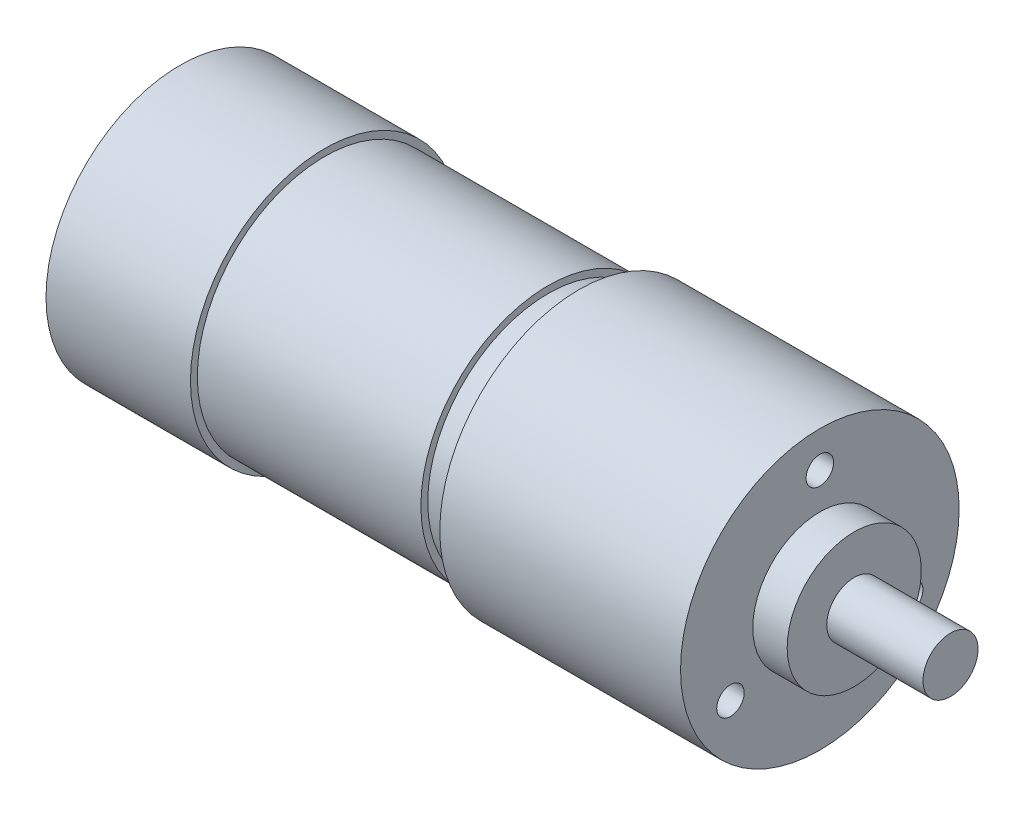
ISO-10303-21;
HEADER;
FILE_DESCRIPTION(('STEP AP214'),'2;1');
FILE_NAME('part.step','',(''),(''),'','','');
FILE_SCHEMA(('AUTOMOTIVE_DESIGN { 1 0 10303 214 1 1 1 1 }'));
ENDSEC;
DATA;
#1=APPLICATION_CONTEXT('core data for automotive mechanical design processes');
#2=APPLICATION_PROTOCOL_DEFINITION('international standard','automotive_design',2000,#1);
#3=PRODUCT_CONTEXT('',#1,'mechanical');
#4=PRODUCT('Part','Part','',(#3));
#5=PRODUCT_RELATED_PRODUCT_CATEGORY('part','',(#4));
#6=PRODUCT_DEFINITION_FORMATION('','',#4);
#7=PRODUCT_DEFINITION_CONTEXT('part definition',#1,'design');
#8=PRODUCT_DEFINITION('design','',#6,#7);
#9=PRODUCT_DEFINITION_SHAPE('','',#8);
#10=(LENGTH_UNIT() NAMED_UNIT(*) SI_UNIT(.MILLI.,.METRE.));
#11=(NAMED_UNIT(*) PLANE_ANGLE_UNIT() SI_UNIT($,.RADIAN.));
#12=(NAMED_UNIT(*) SI_UNIT($,.STERADIAN.) SOLID_ANGLE_UNIT());
#13=UNCERTAINTY_MEASURE_WITH_UNIT(LENGTH_MEASURE(1.E-05),#10,'distance_accuracy_value','');
#14=(GEOMETRIC_REPRESENTATION_CONTEXT(3) GLOBAL_UNCERTAINTY_ASSIGNED_CONTEXT((#13)) GLOBAL_UNIT_ASSIGNED_CONTEXT((#10,
#11,#12)) REPRESENTATION_CONTEXT('',''));
#15=CARTESIAN_POINT('',(0.,0.,0.));
#16=DIRECTION('',(0.,0.,1.));
#17=DIRECTION('',(1.,0.,0.));
#18=AXIS2_PLACEMENT_3D('',#15,#16,#17);
#19=CARTESIAN_POINT('',(0.,0.,0.));
#20=DIRECTION('',(-1.,0.,0.));
#21=DIRECTION('',(0.,0.,-1.));
#22=AXIS2_PLACEMENT_3D('',#19,#20,#21);
#23=PLANE('',#22);
#24=CARTESIAN_POINT('',(0.,0.,0.));
#25=DIRECTION('',(-1.,0.,0.));
#26=DIRECTION('',(0.,0.,1.));
#27=AXIS2_PLACEMENT_3D('',#24,#25,#26);
#28=CIRCLE('',#27,19.5);
#29=CARTESIAN_POINT('',(0.,0.,19.5));
#30=VERTEX_POINT('',#29);
#31=EDGE_CURVE('E10',#30,#30,#28,.T.);
#32=ORIENTED_EDGE('',*,*,#31,.T.);
#33=EDGE_LOOP('',(#32));
#34=FACE_BOUND('',#33,.T.);
#35=ADVANCED_FACE('F37',(#34),#23,.T.);
#36=CARTESIAN_POINT('',(112.,0.,0.));
#37=DIRECTION('',(1.,0.,0.));
#38=DIRECTION('',(0.,0.,1.));
#39=AXIS2_PLACEMENT_3D('',#36,#37,#38);
#40=CYLINDRICAL_SURFACE('',#39,19.5);
#41=ORIENTED_EDGE('',*,*,#31,.F.);
#42=EDGE_LOOP('',(#41));
#43=FACE_BOUND('',#42,.T.);
#44=CARTESIAN_POINT('',(21.,0.,0.));
#45=DIRECTION('',(-1.,0.,0.));
#46=DIRECTION('',(0.,0.,1.));
#47=AXIS2_PLACEMENT_3D('',#44,#45,#46);
#48=CIRCLE('',#47,19.5);
#49=CARTESIAN_POINT('',(21.,0.,19.5));
#50=VERTEX_POINT('',#49);
#51=EDGE_CURVE('E43',#50,#50,#48,.T.);
#52=ORIENTED_EDGE('',*,*,#51,.T.);
#53=EDGE_LOOP('',(#52));
#54=FACE_BOUND('',#53,.T.);
#55=ADVANCED_FACE('F111',(#43,#54),#40,.T.);
#56=CARTESIAN_POINT('',(21.,0.,18.5));
#57=DIRECTION('',(1.,0.,0.));
#58=DIRECTION('',(0.,0.,1.));
#59=AXIS2_PLACEMENT_3D('',#56,#57,#58);
#60=PLANE('',#59);
#61=ORIENTED_EDGE('',*,*,#51,.F.);
#62=EDGE_LOOP('',(#61));
#63=FACE_BOUND('',#62,.T.);
#64=CARTESIAN_POINT('',(21.,0.,0.));
#65=DIRECTION('',(-1.,0.,0.));
#66=DIRECTION('',(0.,0.,1.));
#67=AXIS2_PLACEMENT_3D('',#64,#65,#66);
#68=CIRCLE('',#67,18.5);
#69=CARTESIAN_POINT('',(21.,0.,18.5));
#70=VERTEX_POINT('',#69);
#71=EDGE_CURVE('E47',#70,#70,#68,.T.);
#72=ORIENTED_EDGE('',*,*,#71,.T.);
#73=EDGE_LOOP('',(#72));
#74=FACE_BOUND('',#73,.T.);
#75=ADVANCED_FACE('F115',(#63,#74),#60,.T.);
#76=CARTESIAN_POINT('',(112.,0.,0.));
#77=DIRECTION('',(1.,0.,0.));
#78=DIRECTION('',(0.,0.,1.));
#79=AXIS2_PLACEMENT_3D('',#76,#77,#78);
#80=CYLINDRICAL_SURFACE('',#79,18.5);
#81=ORIENTED_EDGE('',*,*,#71,.F.);
#82=EDGE_LOOP('',(#81));
#83=FACE_BOUND('',#82,.T.);
#84=CARTESIAN_POINT('',(53.5,0.,0.));
#85=DIRECTION('',(-1.,0.,0.));
#86=DIRECTION('',(0.,0.,1.));
#87=AXIS2_PLACEMENT_3D('',#84,#85,#86);
#88=CIRCLE('',#87,18.5);
#89=CARTESIAN_POINT('',(53.5,0.,18.5));
#90=VERTEX_POINT('',#89);
#91=EDGE_CURVE('E51',#90,#90,#88,.T.);
#92=ORIENTED_EDGE('',*,*,#91,.T.);
#93=EDGE_LOOP('',(#92));
#94=FACE_BOUND('',#93,.T.);
#95=ADVANCED_FACE('F120',(#83,#94),#80,.T.);
#96=CARTESIAN_POINT('',(53.5,0.,18.5));
#97=DIRECTION('',(1.,0.,0.));
#98=DIRECTION('',(0.,0.,1.));
#99=AXIS2_PLACEMENT_3D('',#96,#97,#98);
#100=PLANE('',#99);
#101=ORIENTED_EDGE('',*,*,#91,.F.);
#102=EDGE_LOOP('',(#101));
#103=FACE_BOUND('',#102,.T.);
#104=CARTESIAN_POINT('',(53.5,0.,0.));
#105=DIRECTION('',(-1.,0.,0.));
#106=DIRECTION('',(0.,0.,1.));
#107=AXIS2_PLACEMENT_3D('',#104,#105,#106);
#108=CIRCLE('',#107,17.5);
#109=CARTESIAN_POINT('',(53.5,0.,17.5));
#110=VERTEX_POINT('',#109);
#111=EDGE_CURVE('E56',#110,#110,#108,.T.);
#112=ORIENTED_EDGE('',*,*,#111,.T.);
#113=EDGE_LOOP('',(#112));
#114=FACE_BOUND('',#113,.T.);
#115=ADVANCED_FACE('F126',(#103,#114),#100,.T.);
#116=CARTESIAN_POINT('',(112.,0.,0.));
#117=DIRECTION('',(1.,0.,0.));
#118=DIRECTION('',(0.,0.,1.));
#119=AXIS2_PLACEMENT_3D('',#116,#117,#118);
#120=CYLINDRICAL_SURFACE('',#119,17.5);
#121=ORIENTED_EDGE('',*,*,#111,.F.);
#122=EDGE_LOOP('',(#121));
#123=FACE_BOUND('',#122,.T.);
#124=CARTESIAN_POINT('',(58.,0.,0.));
#125=DIRECTION('',(-1.,0.,0.));
#126=DIRECTION('',(0.,0.,1.));
#127=AXIS2_PLACEMENT_3D('',#124,#125,#126);
#128=CIRCLE('',#127,17.5);
#129=CARTESIAN_POINT('',(58.,0.,17.5));
#130=VERTEX_POINT('',#129);
#131=EDGE_CURVE('E59',#130,#130,#128,.T.);
#132=ORIENTED_EDGE('',*,*,#131,.T.);
#133=EDGE_LOOP('',(#132));
#134=FACE_BOUND('',#133,.T.);
#135=ADVANCED_FACE('F130',(#123,#134),#120,.T.);
#136=CARTESIAN_POINT('',(58.,0.,17.5));
#137=DIRECTION('',(-1.,0.,0.));
#138=DIRECTION('',(0.,0.,-1.));
#139=AXIS2_PLACEMENT_3D('',#136,#137,#138);
#140=PLANE('',#139);
#141=ORIENTED_EDGE('',*,*,#131,.F.);
#142=EDGE_LOOP('',(#141));
#143=FACE_BOUND('',#142,.T.);
#144=CARTESIAN_POINT('',(58.,0.,0.));
#145=DIRECTION('',(-1.,0.,0.));
#146=DIRECTION('',(0.,0.,1.));
#147=AXIS2_PLACEMENT_3D('',#144,#145,#146);
#148=CIRCLE('',#147,20.25);
#149=CARTESIAN_POINT('',(58.,0.,20.25));
#150=VERTEX_POINT('',#149);
#151=EDGE_CURVE('E62',#150,#150,#148,.T.);
#152=ORIENTED_EDGE('',*,*,#151,.T.);
#153=EDGE_LOOP('',(#152));
#154=FACE_BOUND('',#153,.T.);
#155=ADVANCED_FACE('F134',(#143,#154),#140,.T.);
#156=CARTESIAN_POINT('',(112.,0.,0.));
#157=DIRECTION('',(1.,0.,0.));
#158=DIRECTION('',(0.,0.,1.));
#159=AXIS2_PLACEMENT_3D('',#156,#157,#158);
#160=CYLINDRICAL_SURFACE('',#159,20.25);
#161=ORIENTED_EDGE('',*,*,#151,.F.);
#162=EDGE_LOOP('',(#161));
#163=FACE_BOUND('',#162,.T.);
#164=CARTESIAN_POINT('',(93.,0.,0.));
#165=DIRECTION('',(-1.,0.,0.));
#166=DIRECTION('',(0.,0.,1.));
#167=AXIS2_PLACEMENT_3D('',#164,#165,#166);
#168=CIRCLE('',#167,20.25);
#169=CARTESIAN_POINT('',(93.,0.,20.25));
#170=VERTEX_POINT('',#169);
#171=EDGE_CURVE('E65',#170,#170,#168,.T.);
#172=ORIENTED_EDGE('',*,*,#171,.T.);
#173=EDGE_LOOP('',(#172));
#174=FACE_BOUND('',#173,.T.);
#175=ADVANCED_FACE('F138',(#163,#174),#160,.T.);
#176=CARTESIAN_POINT('',(93.,0.,20.25));
#177=DIRECTION('',(1.,0.,0.));
#178=DIRECTION('',(0.,0.,1.));
#179=AXIS2_PLACEMENT_3D('',#176,#177,#178);
#180=PLANE('',#179);
#181=CARTESIAN_POINT('',(93.,-7.49999999999988,-12.9903810567666));
#182=DIRECTION('',(-1.,0.,0.));
#183=DIRECTION('',(0.,0.,1.));
#184=AXIS2_PLACEMENT_3D('',#181,#182,#183);
#185=CIRCLE('',#184,2.);
#186=CARTESIAN_POINT('',(93.,-7.49999999999988,-10.9903810567666));
#187=VERTEX_POINT('',#186);
#188=EDGE_CURVE('E93',#187,#187,#185,.T.);
#189=ORIENTED_EDGE('',*,*,#188,.T.);
#190=EDGE_LOOP('',(#189));
#191=FACE_BOUND('',#190,.T.);
#192=CARTESIAN_POINT('',(93.,-7.50000000000006,12.9903810567665));
#193=DIRECTION('',(-1.,0.,0.));
#194=DIRECTION('',(0.,0.,1.));
#195=AXIS2_PLACEMENT_3D('',#192,#193,#194);
#196=CIRCLE('',#195,2.);
#197=CARTESIAN_POINT('',(93.,-7.50000000000006,14.9903810567665));
#198=VERTEX_POINT('',#197);
#199=EDGE_CURVE('E87',#198,#198,#196,.T.);
#200=ORIENTED_EDGE('',*,*,#199,.T.);
#201=EDGE_LOOP('',(#200));
#202=FACE_BOUND('',#201,.T.);
#203=CARTESIAN_POINT('',(93.,15.,0.));
#204=DIRECTION('',(-1.,0.,0.));
#205=DIRECTION('',(0.,0.,1.));
#206=AXIS2_PLACEMENT_3D('',#203,#204,#205);
#207=CIRCLE('',#206,2.);
#208=CARTESIAN_POINT('',(93.,15.,2.));
#209=VERTEX_POINT('',#208);
#210=EDGE_CURVE('E81',#209,#209,#207,.T.);
#211=ORIENTED_EDGE('',*,*,#210,.T.);
#212=EDGE_LOOP('',(#211));
#213=FACE_BOUND('',#212,.T.);
#214=ORIENTED_EDGE('',*,*,#171,.F.);
#215=EDGE_LOOP('',(#214));
#216=FACE_BOUND('',#215,.T.);
#217=CARTESIAN_POINT('',(93.,0.,0.));
#218=DIRECTION('',(-1.,0.,0.));
#219=DIRECTION('',(0.,0.,1.));
#220=AXIS2_PLACEMENT_3D('',#217,#218,#219);
#221=CIRCLE('',#220,9.75);
#222=CARTESIAN_POINT('',(93.,0.,9.75));
#223=VERTEX_POINT('',#222);
#224=EDGE_CURVE('E68',#223,#223,#221,.T.);
#225=ORIENTED_EDGE('',*,*,#224,.T.);
#226=EDGE_LOOP('',(#225));
#227=FACE_BOUND('',#226,.T.);
#228=ADVANCED_FACE('F142',(#191,#202,#213,#216,#227),#180,.T.);
#229=CARTESIAN_POINT('',(112.,0.,0.));
#230=DIRECTION('',(1.,0.,0.));
#231=DIRECTION('',(0.,0.,1.));
#232=AXIS2_PLACEMENT_3D('',#229,#230,#231);
#233=CYLINDRICAL_SURFACE('',#232,9.75);
#234=ORIENTED_EDGE('',*,*,#224,.F.);
#235=EDGE_LOOP('',(#234));
#236=FACE_BOUND('',#235,.T.);
#237=CARTESIAN_POINT('',(98.,0.,0.));
#238=DIRECTION('',(-1.,0.,0.));
#239=DIRECTION('',(0.,0.,1.));
#240=AXIS2_PLACEMENT_3D('',#237,#238,#239);
#241=CIRCLE('',#240,9.75);
#242=CARTESIAN_POINT('',(98.,0.,9.75));
#243=VERTEX_POINT('',#242);
#244=EDGE_CURVE('E71',#243,#243,#241,.T.);
#245=ORIENTED_EDGE('',*,*,#244,.T.);
#246=EDGE_LOOP('',(#245));
#247=FACE_BOUND('',#246,.T.);
#248=ADVANCED_FACE('F146',(#236,#247),#233,.T.);
#249=CARTESIAN_POINT('',(98.,0.,9.75));
#250=DIRECTION('',(1.,0.,0.));
#251=DIRECTION('',(0.,0.,1.));
#252=AXIS2_PLACEMENT_3D('',#249,#250,#251);
#253=PLANE('',#252);
#254=ORIENTED_EDGE('',*,*,#244,.F.);
#255=EDGE_LOOP('',(#254));
#256=FACE_BOUND('',#255,.T.);
#257=CARTESIAN_POINT('',(98.,0.,0.));
#258=DIRECTION('',(-1.,0.,0.));
#259=DIRECTION('',(0.,0.,1.));
#260=AXIS2_PLACEMENT_3D('',#257,#258,#259);
#261=CIRCLE('',#260,4.);
#262=CARTESIAN_POINT('',(98.,0.,4.));
#263=VERTEX_POINT('',#262);
#264=EDGE_CURVE('E74',#263,#263,#261,.T.);
#265=ORIENTED_EDGE('',*,*,#264,.T.);
#266=EDGE_LOOP('',(#265));
#267=FACE_BOUND('',#266,.T.);
#268=ADVANCED_FACE('F150',(#256,#267),#253,.T.);
#269=CARTESIAN_POINT('',(112.,0.,0.));
#270=DIRECTION('',(1.,0.,0.));
#271=DIRECTION('',(0.,0.,1.));
#272=AXIS2_PLACEMENT_3D('',#269,#270,#271);
#273=CYLINDRICAL_SURFACE('',#272,4.);
#274=ORIENTED_EDGE('',*,*,#264,.F.);
#275=EDGE_LOOP('',(#274));
#276=FACE_BOUND('',#275,.T.);
#277=CARTESIAN_POINT('',(112.,0.,0.));
#278=DIRECTION('',(-1.,0.,0.));
#279=DIRECTION('',(0.,0.,1.));
#280=AXIS2_PLACEMENT_3D('',#277,#278,#279);
#281=CIRCLE('',#280,4.);
#282=CARTESIAN_POINT('',(112.,0.,4.));
#283=VERTEX_POINT('',#282);
#284=EDGE_CURVE('E77',#283,#283,#281,.T.);
#285=ORIENTED_EDGE('',*,*,#284,.T.);
#286=EDGE_LOOP('',(#285));
#287=FACE_BOUND('',#286,.T.);
#288=ADVANCED_FACE('F154',(#276,#287),#273,.T.);
#289=CARTESIAN_POINT('',(112.,0.,4.));
#290=DIRECTION('',(1.,0.,0.));
#291=DIRECTION('',(0.,0.,1.));
#292=AXIS2_PLACEMENT_3D('',#289,#290,#291);
#293=PLANE('',#292);
#294=ORIENTED_EDGE('',*,*,#284,.F.);
#295=EDGE_LOOP('',(#294));
#296=FACE_BOUND('',#295,.T.);
#297=ADVANCED_FACE('F158',(#296),#293,.T.);
#298=CARTESIAN_POINT('',(85.,15.,0.));
#299=DIRECTION('',(1.,0.,0.));
#300=DIRECTION('',(0.,0.,1.));
#301=AXIS2_PLACEMENT_3D('',#298,#299,#300);
#302=CYLINDRICAL_SURFACE('',#301,2.);
#303=CARTESIAN_POINT('',(85.,15.,0.));
#304=DIRECTION('',(-1.,0.,0.));
#305=DIRECTION('',(0.,0.,1.));
#306=AXIS2_PLACEMENT_3D('',#303,#304,#305);
#307=CIRCLE('',#306,2.);
#308=CARTESIAN_POINT('',(85.,15.,2.));
#309=VERTEX_POINT('',#308);
#310=EDGE_CURVE('E80',#309,#309,#307,.T.);
#311=ORIENTED_EDGE('',*,*,#310,.T.);
#312=EDGE_LOOP('',(#311));
#313=FACE_BOUND('',#312,.T.);
#314=ORIENTED_EDGE('',*,*,#210,.F.);
#315=EDGE_LOOP('',(#314));
#316=FACE_BOUND('',#315,.T.);
#317=ADVANCED_FACE('F162',(#313,#316),#302,.F.);
#318=CARTESIAN_POINT('',(85.,15.,0.));
#319=DIRECTION('',(1.,0.,0.));
#320=DIRECTION('',(0.,0.,1.));
#321=AXIS2_PLACEMENT_3D('',#318,#319,#320);
#322=PLANE('',#321);
#323=ORIENTED_EDGE('',*,*,#310,.F.);
#324=EDGE_LOOP('',(#323));
#325=FACE_BOUND('',#324,.T.);
#326=ADVANCED_FACE('F166',(#325),#322,.T.);
#327=CARTESIAN_POINT('',(85.,-7.50000000000006,12.9903810567665));
#328=DIRECTION('',(1.,0.,0.));
#329=DIRECTION('',(0.,0.,1.));
#330=AXIS2_PLACEMENT_3D('',#327,#328,#329);
#331=CYLINDRICAL_SURFACE('',#330,2.);
#332=CARTESIAN_POINT('',(85.,-7.50000000000006,12.9903810567665));
#333=DIRECTION('',(-1.,0.,0.));
#334=DIRECTION('',(0.,0.,1.));
#335=AXIS2_PLACEMENT_3D('',#332,#333,#334);
#336=CIRCLE('',#335,2.);
#337=CARTESIAN_POINT('',(85.,-7.50000000000006,14.9903810567665));
#338=VERTEX_POINT('',#337);
#339=EDGE_CURVE('E84',#338,#338,#336,.T.);
#340=ORIENTED_EDGE('',*,*,#339,.T.);
#341=EDGE_LOOP('',(#340));
#342=FACE_BOUND('',#341,.T.);
#343=ORIENTED_EDGE('',*,*,#199,.F.);
#344=EDGE_LOOP('',(#343));
#345=FACE_BOUND('',#344,.T.);
#346=ADVANCED_FACE('F170',(#342,#345),#331,.F.);
#347=CARTESIAN_POINT('',(85.,-7.50000000000006,12.9903810567665));
#348=DIRECTION('',(1.,0.,0.));
#349=DIRECTION('',(0.,0.,1.));
#350=AXIS2_PLACEMENT_3D('',#347,#348,#349);
#351=PLANE('',#350);
#352=ORIENTED_EDGE('',*,*,#339,.F.);
#353=EDGE_LOOP('',(#352));
#354=FACE_BOUND('',#353,.T.);
#355=ADVANCED_FACE('F108',(#354),#351,.T.);
#356=CARTESIAN_POINT('',(85.,-7.49999999999988,-12.9903810567666));
#357=DIRECTION('',(1.,0.,0.));
#358=DIRECTION('',(0.,0.,1.));
#359=AXIS2_PLACEMENT_3D('',#356,#357,#358);
#360=CYLINDRICAL_SURFACE('',#359,2.);
#361=CARTESIAN_POINT('',(85.,-7.49999999999988,-12.9903810567666));
#362=DIRECTION('',(-1.,0.,0.));
#363=DIRECTION('',(0.,0.,1.));
#364=AXIS2_PLACEMENT_3D('',#361,#362,#363);
#365=CIRCLE('',#364,2.);
#366=CARTESIAN_POINT('',(85.,-7.49999999999988,-10.9903810567666));
#367=VERTEX_POINT('',#366);
#368=EDGE_CURVE('E90',#367,#367,#365,.T.);
#369=ORIENTED_EDGE('',*,*,#368,.T.);
#370=EDGE_LOOP('',(#369));
#371=FACE_BOUND('',#370,.T.);
#372=ORIENTED_EDGE('',*,*,#188,.F.);
#373=EDGE_LOOP('',(#372));
#374=FACE_BOUND('',#373,.T.);
#375=ADVANCED_FACE('F99',(#371,#374),#360,.F.);
#376=CARTESIAN_POINT('',(85.,-7.49999999999988,-12.9903810567666));
#377=DIRECTION('',(1.,0.,0.));
#378=DIRECTION('',(0.,0.,1.));
#379=AXIS2_PLACEMENT_3D('',#376,#377,#378);
#380=PLANE('',#379);
#381=ORIENTED_EDGE('',*,*,#368,.F.);
#382=EDGE_LOOP('',(#381));
#383=FACE_BOUND('',#382,.T.);
#384=ADVANCED_FACE('F102',(#383),#380,.T.);
#385=CLOSED_SHELL('',(#35,#55,#75,#95,#115,#135,#155,#175,#228,#248,#268,#288,#297,#317,#326,
#346,#355,#375,#384));
#386=MANIFOLD_SOLID_BREP('B2',#385);
#387=ADVANCED_BREP_SHAPE_REPRESENTATION('',(#18,#386),#14);
#388=SHAPE_DEFINITION_REPRESENTATION(#9,#387);
ENDSEC;
END-ISO-10303-21;
